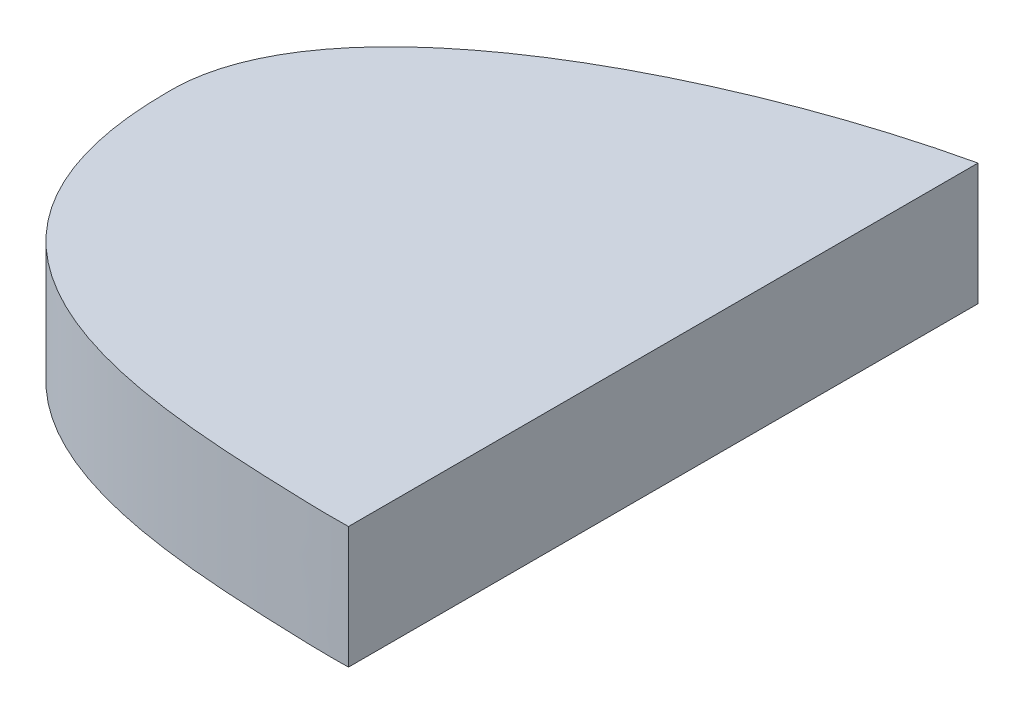
ISO-10303-21;
HEADER;
FILE_DESCRIPTION(('STEP AP214'),'2;1');
FILE_NAME('part.step','',(''),(''),'','','');
FILE_SCHEMA(('AUTOMOTIVE_DESIGN { 1 0 10303 214 1 1 1 1 }'));
ENDSEC;
DATA;
#1=APPLICATION_CONTEXT('core data for automotive mechanical design processes');
#2=APPLICATION_PROTOCOL_DEFINITION('international standard','automotive_design',2000,#1);
#3=PRODUCT_CONTEXT('',#1,'mechanical');
#4=PRODUCT('Part','Part','',(#3));
#5=PRODUCT_RELATED_PRODUCT_CATEGORY('part','',(#4));
#6=PRODUCT_DEFINITION_FORMATION('','',#4);
#7=PRODUCT_DEFINITION_CONTEXT('part definition',#1,'design');
#8=PRODUCT_DEFINITION('design','',#6,#7);
#9=PRODUCT_DEFINITION_SHAPE('','',#8);
#10=(LENGTH_UNIT() NAMED_UNIT(*) SI_UNIT(.MILLI.,.METRE.));
#11=(NAMED_UNIT(*) PLANE_ANGLE_UNIT() SI_UNIT($,.RADIAN.));
#12=(NAMED_UNIT(*) SI_UNIT($,.STERADIAN.) SOLID_ANGLE_UNIT());
#13=UNCERTAINTY_MEASURE_WITH_UNIT(LENGTH_MEASURE(1.E-05),#10,'distance_accuracy_value','');
#14=(GEOMETRIC_REPRESENTATION_CONTEXT(3) GLOBAL_UNCERTAINTY_ASSIGNED_CONTEXT((#13)) GLOBAL_UNIT_ASSIGNED_CONTEXT((#10,
#11,#12)) REPRESENTATION_CONTEXT('',''));
#15=CARTESIAN_POINT('',(0.,0.,0.));
#16=DIRECTION('',(0.,0.,1.));
#17=DIRECTION('',(1.,0.,0.));
#18=AXIS2_PLACEMENT_3D('',#15,#16,#17);
#19=CARTESIAN_POINT('',(-109.1,10.,5.10000000000001));
#20=CARTESIAN_POINT('',(-109.1,10.,26.6432604195566));
#21=CARTESIAN_POINT('',(-85.1553950145299,10.,28.3276547789506));
#22=CARTESIAN_POINT('',(-58.1139650986849,10.,28.9794823332857));
#23=CARTESIAN_POINT('',(-41.2186170202285,10.,17.3728864624876));
#24=CARTESIAN_POINT('',(-19.7963856893989,10.,17.3572232978144));
#25=CARTESIAN_POINT('',(-8.53740891077196,10.,19.1352043184809));
#26=CARTESIAN_POINT('',(9.6283391946368,10.,19.5586498872572));
#27=CARTESIAN_POINT('',(19.6,10.,12.7982081123207));
#28=CARTESIAN_POINT('',(19.6,10.,0.));
#29=B_SPLINE_CURVE_WITH_KNOTS('',3,(#19,#20,#21,#22,#23,#24,#25,#26,#27,#28),.UNSPECIFIED.,.F.,
.F.,(4,1,1,1,1,1,1,4),(0.,0.259156642468506,0.320592471258994,0.581717641610898,
0.633520200090735,0.786815497577522,0.825379668787033,1.),.UNSPECIFIED.);
#30=DIRECTION('',(0.,-1.,0.));
#31=VECTOR('',#30,1.);
#32=SURFACE_OF_LINEAR_EXTRUSION('',#29,#31);
#33=CARTESIAN_POINT('',(-109.1,0.,5.10000000000001));
#34=CARTESIAN_POINT('',(-109.1,0.,26.6432604195566));
#35=CARTESIAN_POINT('',(-85.1553950145299,0.,28.3276547789506));
#36=CARTESIAN_POINT('',(-58.1139650986849,0.,28.9794823332857));
#37=CARTESIAN_POINT('',(-41.2186170202285,0.,17.3728864624876));
#38=CARTESIAN_POINT('',(-19.7963856893989,0.,17.3572232978144));
#39=CARTESIAN_POINT('',(-8.53740891077196,0.,19.1352043184809));
#40=CARTESIAN_POINT('',(9.6283391946368,0.,19.5586498872572));
#41=CARTESIAN_POINT('',(19.6,0.,12.7982081123207));
#42=CARTESIAN_POINT('',(19.6,0.,0.));
#43=B_SPLINE_CURVE_WITH_KNOTS('',3,(#33,#34,#35,#36,#37,#38,#39,#40,#41,#42),.UNSPECIFIED.,.F.,
.F.,(4,1,1,1,1,1,1,4),(0.,0.259156642468506,0.320592471258994,0.581717641610898,
0.633520200090735,0.786815497577522,0.825379668787033,1.),.UNSPECIFIED.);
#44=CARTESIAN_POINT('',(-109.1,0.,5.10000000000001));
#45=VERTEX_POINT('',#44);
#46=CARTESIAN_POINT('',(-70.7928808613706,0.,28.5876592009826));
#47=VERTEX_POINT('',#46);
#48=EDGE_CURVE('E89',#45,#47,#43,.T.);
#49=ORIENTED_EDGE('',*,*,#48,.T.);
#50=DIRECTION('',(0.,-1.,0.));
#51=VECTOR('',#50,1.);
#52=CARTESIAN_POINT('',(-70.7928808613739,10.,28.5876592009827));
#53=LINE('',#52,#51);
#54=CARTESIAN_POINT('',(-70.7928808613739,10.,28.5876592009826));
#55=VERTEX_POINT('',#54);
#56=EDGE_CURVE('E48',#47,#55,#53,.F.);
#57=ORIENTED_EDGE('',*,*,#56,.T.);
#58=CARTESIAN_POINT('',(-109.1,10.,5.10000000000001));
#59=VERTEX_POINT('',#58);
#60=EDGE_CURVE('E75',#59,#55,#29,.T.);
#61=ORIENTED_EDGE('',*,*,#60,.F.);
#62=DIRECTION('',(0.,-1.,0.));
#63=VECTOR('',#62,1.);
#64=CARTESIAN_POINT('',(-109.1,10.,5.10000000000001));
#65=LINE('',#64,#63);
#66=EDGE_CURVE('E41',#59,#45,#65,.T.);
#67=ORIENTED_EDGE('',*,*,#66,.T.);
#68=EDGE_LOOP('',(#49,#57,#61,#67));
#69=FACE_BOUND('',#68,.T.);
#70=ADVANCED_FACE('F33',(#69),#32,.F.);
#71=CARTESIAN_POINT('',(19.6,10.,0.));
#72=CARTESIAN_POINT('',(19.6,10.,-14.2893005053947));
#73=CARTESIAN_POINT('',(7.1735976624603,10.,-19.9351832568845));
#74=CARTESIAN_POINT('',(-9.83146438799062,10.,-20.089562679808));
#75=CARTESIAN_POINT('',(-19.7454128209937,10.,-17.5567998115002));
#76=CARTESIAN_POINT('',(-34.2195404956932,10.,-17.8508309102311));
#77=CARTESIAN_POINT('',(-43.020276745773,10.,-23.9373098477562));
#78=CARTESIAN_POINT('',(-73.7876257334462,10.,-25.2227035796245));
#79=CARTESIAN_POINT('',(-109.424609825548,10.,-10.4414719107757));
#80=CARTESIAN_POINT('',(-109.1,10.,5.10000000000001));
#81=B_SPLINE_CURVE_WITH_KNOTS('',3,(#71,#72,#73,#74,#75,#76,#77,#78,#79,#80),.UNSPECIFIED.,.F.,
.F.,(4,1,1,1,1,1,1,4),(0.,0.235629762694766,0.280037523195015,0.425850929246104,
0.474049388826953,0.713823659422654,0.769415898922405,1.),.UNSPECIFIED.);
#82=DIRECTION('',(0.,-1.,0.));
#83=VECTOR('',#82,1.);
#84=SURFACE_OF_LINEAR_EXTRUSION('',#81,#83);
#85=CARTESIAN_POINT('',(-70.7928808613739,10.,-23.0849059358665));
#86=VERTEX_POINT('',#85);
#87=EDGE_CURVE('E56',#86,#59,#81,.T.);
#88=ORIENTED_EDGE('',*,*,#87,.F.);
#89=DIRECTION('',(0.,-1.,0.));
#90=VECTOR('',#89,1.);
#91=CARTESIAN_POINT('',(-70.7928808613737,10.,-23.084905938054));
#92=LINE('',#91,#90);
#93=CARTESIAN_POINT('',(-70.7928808613739,0.,-23.0849059358665));
#94=VERTEX_POINT('',#93);
#95=EDGE_CURVE('E67',#86,#94,#92,.T.);
#96=ORIENTED_EDGE('',*,*,#95,.T.);
#97=CARTESIAN_POINT('',(19.6,0.,0.));
#98=CARTESIAN_POINT('',(19.6,0.,-14.2893005053947));
#99=CARTESIAN_POINT('',(7.1735976624603,0.,-19.9351832568845));
#100=CARTESIAN_POINT('',(-9.83146438799062,0.,-20.089562679808));
#101=CARTESIAN_POINT('',(-19.7454128209937,0.,-17.5567998115002));
#102=CARTESIAN_POINT('',(-34.2195404956932,0.,-17.8508309102311));
#103=CARTESIAN_POINT('',(-43.020276745773,0.,-23.9373098477562));
#104=CARTESIAN_POINT('',(-73.7876257334462,0.,-25.2227035796245));
#105=CARTESIAN_POINT('',(-109.424609825548,0.,-10.4414719107757));
#106=CARTESIAN_POINT('',(-109.1,0.,5.10000000000001));
#107=B_SPLINE_CURVE_WITH_KNOTS('',3,(#97,#98,#99,#100,#101,#102,#103,#104,#105,#106),
.UNSPECIFIED.,.F.,.F.,(4,1,1,1,1,1,1,4),(0.,0.235629762694766,0.280037523195015,
0.425850929246104,0.474049388826953,0.713823659422654,0.769415898922405,1.),.UNSPECIFIED.);
#108=EDGE_CURVE('E80',#94,#45,#107,.T.);
#109=ORIENTED_EDGE('',*,*,#108,.T.);
#110=ORIENTED_EDGE('',*,*,#66,.F.);
#111=EDGE_LOOP('',(#88,#96,#109,#110));
#112=FACE_BOUND('',#111,.T.);
#113=ADVANCED_FACE('F77',(#112),#84,.F.);
#114=CARTESIAN_POINT('',(-42.7866665549931,10.,20.4642477072215));
#115=DIRECTION('',(0.,1.,0.));
#116=DIRECTION('',(0.,0.,1.));
#117=AXIS2_PLACEMENT_3D('',#114,#115,#116);
#118=PLANE('',#117);
#119=DIRECTION('',(0.,0.,1.));
#120=VECTOR('',#119,1.);
#121=CARTESIAN_POINT('',(-70.7928808613739,10.,-36.6353333657289));
#122=LINE('',#121,#120);
#123=EDGE_CURVE('E69',#86,#55,#122,.T.);
#124=ORIENTED_EDGE('',*,*,#123,.F.);
#125=ORIENTED_EDGE('',*,*,#87,.T.);
#126=ORIENTED_EDGE('',*,*,#60,.T.);
#127=EDGE_LOOP('',(#124,#125,#126));
#128=FACE_BOUND('',#127,.T.);
#129=ADVANCED_FACE('F73',(#128),#118,.T.);
#130=CARTESIAN_POINT('',(-42.7866665549931,0.,20.4642477072215));
#131=DIRECTION('',(0.,1.,0.));
#132=DIRECTION('',(0.,0.,1.));
#133=AXIS2_PLACEMENT_3D('',#130,#131,#132);
#134=PLANE('',#133);
#135=ORIENTED_EDGE('',*,*,#108,.F.);
#136=DIRECTION('',(0.,0.,1.));
#137=VECTOR('',#136,1.);
#138=CARTESIAN_POINT('',(-70.7928808613739,0.,20.4642477072215));
#139=LINE('',#138,#137);
#140=EDGE_CURVE('E11',#94,#47,#139,.T.);
#141=ORIENTED_EDGE('',*,*,#140,.T.);
#142=ORIENTED_EDGE('',*,*,#48,.F.);
#143=EDGE_LOOP('',(#135,#141,#142));
#144=FACE_BOUND('',#143,.T.);
#145=ADVANCED_FACE('F98',(#144),#134,.F.);
#146=CARTESIAN_POINT('',(-70.7928808613739,0.,-36.6353333657289));
#147=DIRECTION('',(-1.,0.,0.));
#148=DIRECTION('',(0.,0.,1.));
#149=AXIS2_PLACEMENT_3D('',#146,#147,#148);
#150=PLANE('',#149);
#151=ORIENTED_EDGE('',*,*,#140,.F.);
#152=ORIENTED_EDGE('',*,*,#95,.F.);
#153=ORIENTED_EDGE('',*,*,#123,.T.);
#154=ORIENTED_EDGE('',*,*,#56,.F.);
#155=EDGE_LOOP('',(#151,#152,#153,#154));
#156=FACE_BOUND('',#155,.T.);
#157=ADVANCED_FACE('F68',(#156),#150,.F.);
#158=CLOSED_SHELL('',(#70,#113,#129,#145,#157));
#159=MANIFOLD_SOLID_BREP('B2',#158);
#160=ADVANCED_BREP_SHAPE_REPRESENTATION('',(#18,#159),#14);
#161=SHAPE_DEFINITION_REPRESENTATION(#9,#160);
ENDSEC;
END-ISO-10303-21;
